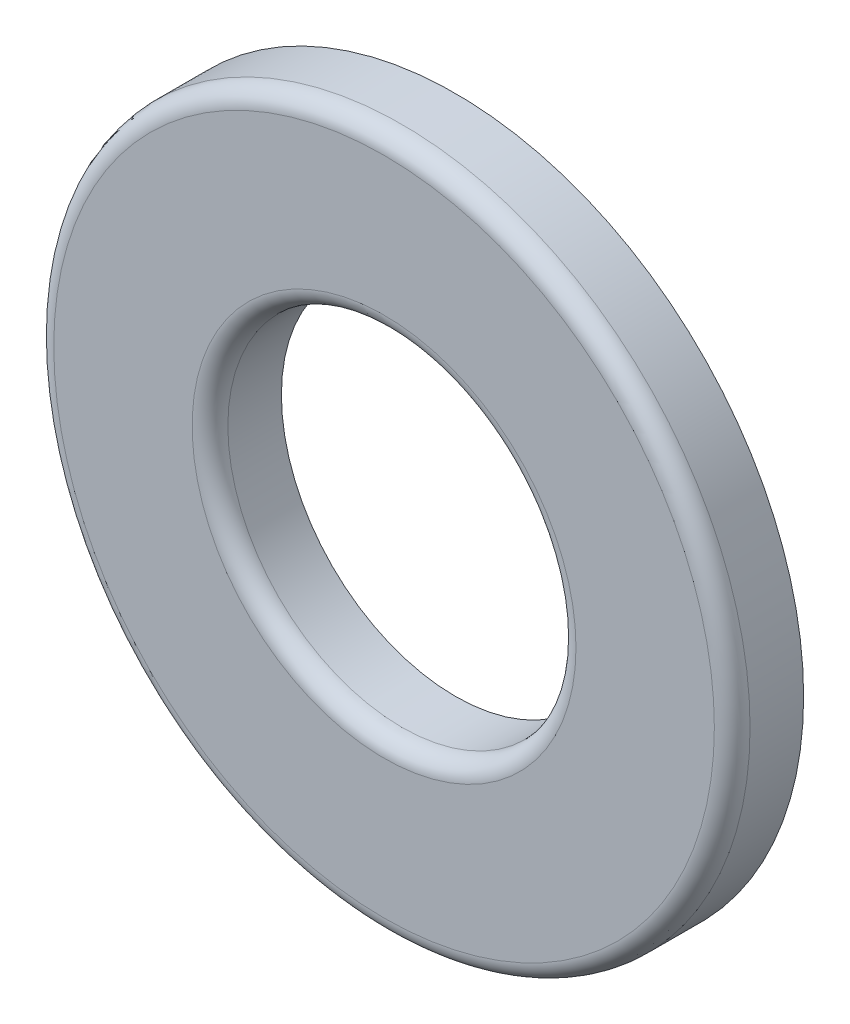
ISO-10303-21;
HEADER;
FILE_DESCRIPTION(('STEP AP214'),'2;1');
FILE_NAME('part.step','',(''),(''),'','','');
FILE_SCHEMA(('AUTOMOTIVE_DESIGN { 1 0 10303 214 1 1 1 1 }'));
ENDSEC;
DATA;
#1=APPLICATION_CONTEXT('core data for automotive mechanical design processes');
#2=APPLICATION_PROTOCOL_DEFINITION('international standard','automotive_design',2000,#1);
#3=PRODUCT_CONTEXT('',#1,'mechanical');
#4=PRODUCT('Part','Part','',(#3));
#5=PRODUCT_RELATED_PRODUCT_CATEGORY('part','',(#4));
#6=PRODUCT_DEFINITION_FORMATION('','',#4);
#7=PRODUCT_DEFINITION_CONTEXT('part definition',#1,'design');
#8=PRODUCT_DEFINITION('design','',#6,#7);
#9=PRODUCT_DEFINITION_SHAPE('','',#8);
#10=(LENGTH_UNIT() NAMED_UNIT(*) SI_UNIT(.MILLI.,.METRE.));
#11=(NAMED_UNIT(*) PLANE_ANGLE_UNIT() SI_UNIT($,.RADIAN.));
#12=(NAMED_UNIT(*) SI_UNIT($,.STERADIAN.) SOLID_ANGLE_UNIT());
#13=UNCERTAINTY_MEASURE_WITH_UNIT(LENGTH_MEASURE(1.E-05),#10,'distance_accuracy_value','');
#14=(GEOMETRIC_REPRESENTATION_CONTEXT(3) GLOBAL_UNCERTAINTY_ASSIGNED_CONTEXT((#13)) GLOBAL_UNIT_ASSIGNED_CONTEXT((#10,
#11,#12)) REPRESENTATION_CONTEXT('',''));
#15=CARTESIAN_POINT('',(0.,0.,0.));
#16=DIRECTION('',(0.,0.,1.));
#17=DIRECTION('',(1.,0.,0.));
#18=AXIS2_PLACEMENT_3D('',#15,#16,#17);
#19=CARTESIAN_POINT('',(0.,0.,0.406399999999997));
#20=DIRECTION('',(0.,0.,1.));
#21=DIRECTION('',(1.,0.,0.));
#22=AXIS2_PLACEMENT_3D('',#19,#20,#21);
#23=PLANE('',#22);
#24=CARTESIAN_POINT('',(0.,0.,0.406399999999997));
#25=DIRECTION('',(0.,0.,1.));
#26=DIRECTION('',(1.,0.,0.));
#27=AXIS2_PLACEMENT_3D('',#24,#25,#26);
#28=CIRCLE('',#27,3.7592);
#29=CARTESIAN_POINT('',(3.7592,0.,0.406399999999997));
#30=VERTEX_POINT('',#29);
#31=EDGE_CURVE('E56',#30,#30,#28,.T.);
#32=ORIENTED_EDGE('',*,*,#31,.T.);
#33=EDGE_LOOP('',(#32));
#34=FACE_BOUND('',#33,.T.);
#35=CARTESIAN_POINT('',(0.,0.,0.406399999999997));
#36=DIRECTION('',(0.,0.,1.));
#37=DIRECTION('',(1.,0.,0.));
#38=AXIS2_PLACEMENT_3D('',#35,#36,#37);
#39=CIRCLE('',#38,2.1844);
#40=CARTESIAN_POINT('',(2.1844,0.,0.406399999999997));
#41=VERTEX_POINT('',#40);
#42=EDGE_CURVE('E61',#41,#41,#39,.F.);
#43=ORIENTED_EDGE('',*,*,#42,.T.);
#44=EDGE_LOOP('',(#43));
#45=FACE_BOUND('',#44,.T.);
#46=ADVANCED_FACE('F43',(#34,#45),#23,.T.);
#47=CARTESIAN_POINT('',(0.,0.,0.406399999999997));
#48=DIRECTION('',(0.,0.,-1.));
#49=DIRECTION('',(-1.,0.,0.));
#50=AXIS2_PLACEMENT_3D('',#47,#48,#49);
#51=CYLINDRICAL_SURFACE('',#50,3.9624);
#52=CARTESIAN_POINT('',(0.,0.,0.203199999999997));
#53=DIRECTION('',(0.,0.,1.));
#54=DIRECTION('',(1.,0.,0.));
#55=AXIS2_PLACEMENT_3D('',#52,#53,#54);
#56=CIRCLE('',#55,3.9624);
#57=CARTESIAN_POINT('',(3.9624,0.,0.203199999999997));
#58=VERTEX_POINT('',#57);
#59=EDGE_CURVE('E51',#58,#58,#56,.F.);
#60=ORIENTED_EDGE('',*,*,#59,.T.);
#61=EDGE_LOOP('',(#60));
#62=FACE_BOUND('',#61,.T.);
#63=CARTESIAN_POINT('',(0.,0.,-0.406400000000003));
#64=DIRECTION('',(0.,0.,1.));
#65=DIRECTION('',(1.,0.,0.));
#66=AXIS2_PLACEMENT_3D('',#63,#64,#65);
#67=CIRCLE('',#66,3.9624);
#68=CARTESIAN_POINT('',(3.9624,0.,-0.406400000000003));
#69=VERTEX_POINT('',#68);
#70=EDGE_CURVE('E67',#69,#69,#67,.T.);
#71=ORIENTED_EDGE('',*,*,#70,.T.);
#72=EDGE_LOOP('',(#71));
#73=FACE_BOUND('',#72,.T.);
#74=ADVANCED_FACE('F81',(#62,#73),#51,.T.);
#75=CARTESIAN_POINT('',(0.,0.,0.406399999999997));
#76=DIRECTION('',(0.,0.,-1.));
#77=DIRECTION('',(-1.,0.,0.));
#78=AXIS2_PLACEMENT_3D('',#75,#76,#77);
#79=CYLINDRICAL_SURFACE('',#78,1.9812);
#80=CARTESIAN_POINT('',(0.,0.,0.203199999999997));
#81=DIRECTION('',(0.,0.,1.));
#82=DIRECTION('',(1.,0.,0.));
#83=AXIS2_PLACEMENT_3D('',#80,#81,#82);
#84=CIRCLE('',#83,1.9812);
#85=CARTESIAN_POINT('',(1.9812,0.,0.203199999999997));
#86=VERTEX_POINT('',#85);
#87=EDGE_CURVE('E10',#86,#86,#84,.T.);
#88=ORIENTED_EDGE('',*,*,#87,.T.);
#89=EDGE_LOOP('',(#88));
#90=FACE_BOUND('',#89,.T.);
#91=CARTESIAN_POINT('',(0.,0.,-0.406400000000003));
#92=DIRECTION('',(0.,0.,1.));
#93=DIRECTION('',(1.,0.,0.));
#94=AXIS2_PLACEMENT_3D('',#91,#92,#93);
#95=CIRCLE('',#94,1.9812);
#96=CARTESIAN_POINT('',(1.9812,0.,-0.406400000000003));
#97=VERTEX_POINT('',#96);
#98=EDGE_CURVE('E71',#97,#97,#95,.T.);
#99=ORIENTED_EDGE('',*,*,#98,.F.);
#100=EDGE_LOOP('',(#99));
#101=FACE_BOUND('',#100,.T.);
#102=ADVANCED_FACE('F79',(#90,#101),#79,.F.);
#103=CARTESIAN_POINT('',(0.,0.,-0.406400000000003));
#104=DIRECTION('',(0.,0.,1.));
#105=DIRECTION('',(1.,0.,0.));
#106=AXIS2_PLACEMENT_3D('',#103,#104,#105);
#107=PLANE('',#106);
#108=ORIENTED_EDGE('',*,*,#98,.T.);
#109=EDGE_LOOP('',(#108));
#110=FACE_BOUND('',#109,.T.);
#111=ORIENTED_EDGE('',*,*,#70,.F.);
#112=EDGE_LOOP('',(#111));
#113=FACE_BOUND('',#112,.T.);
#114=ADVANCED_FACE('F76',(#110,#113),#107,.F.);
#115=CARTESIAN_POINT('',(0.,0.,0.203199999999997));
#116=DIRECTION('',(0.,0.,1.));
#117=DIRECTION('',(1.,0.,0.));
#118=AXIS2_PLACEMENT_3D('',#115,#116,#117);
#119=TOROIDAL_SURFACE('',#118,3.7592,0.2032);
#120=ORIENTED_EDGE('',*,*,#59,.F.);
#121=EDGE_LOOP('',(#120));
#122=FACE_BOUND('',#121,.T.);
#123=ORIENTED_EDGE('',*,*,#31,.F.);
#124=EDGE_LOOP('',(#123));
#125=FACE_BOUND('',#124,.T.);
#126=ADVANCED_FACE('F88',(#122,#125),#119,.T.);
#127=CARTESIAN_POINT('',(0.,0.,0.203199999999997));
#128=DIRECTION('',(0.,0.,1.));
#129=DIRECTION('',(1.,0.,0.));
#130=AXIS2_PLACEMENT_3D('',#127,#128,#129);
#131=TOROIDAL_SURFACE('',#130,2.1844,0.2032);
#132=ORIENTED_EDGE('',*,*,#42,.F.);
#133=EDGE_LOOP('',(#132));
#134=FACE_BOUND('',#133,.T.);
#135=ORIENTED_EDGE('',*,*,#87,.F.);
#136=EDGE_LOOP('',(#135));
#137=FACE_BOUND('',#136,.T.);
#138=ADVANCED_FACE('F45',(#134,#137),#131,.T.);
#139=CLOSED_SHELL('',(#46,#74,#102,#114,#126,#138));
#140=MANIFOLD_SOLID_BREP('B2',#139);
#141=ADVANCED_BREP_SHAPE_REPRESENTATION('',(#18,#140),#14);
#142=SHAPE_DEFINITION_REPRESENTATION(#9,#141);
ENDSEC;
END-ISO-10303-21;
